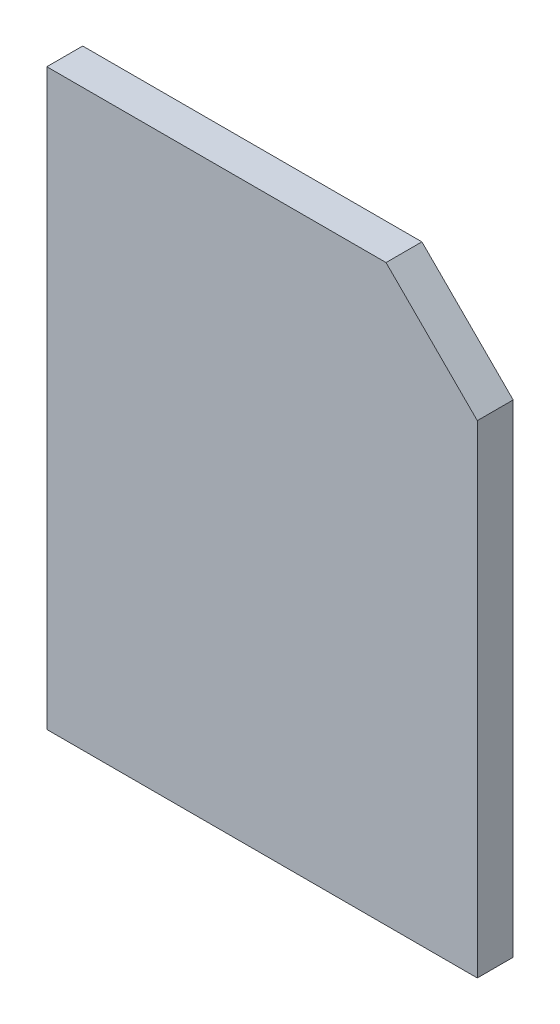
ISO-10303-21;
HEADER;
FILE_DESCRIPTION(('STEP AP214'),'2;1');
FILE_NAME('part.step','',(''),(''),'','','');
FILE_SCHEMA(('AUTOMOTIVE_DESIGN { 1 0 10303 214 1 1 1 1 }'));
ENDSEC;
DATA;
#1=APPLICATION_CONTEXT('core data for automotive mechanical design processes');
#2=APPLICATION_PROTOCOL_DEFINITION('international standard','automotive_design',2000,#1);
#3=PRODUCT_CONTEXT('',#1,'mechanical');
#4=PRODUCT('Part','Part','',(#3));
#5=PRODUCT_RELATED_PRODUCT_CATEGORY('part','',(#4));
#6=PRODUCT_DEFINITION_FORMATION('','',#4);
#7=PRODUCT_DEFINITION_CONTEXT('part definition',#1,'design');
#8=PRODUCT_DEFINITION('design','',#6,#7);
#9=PRODUCT_DEFINITION_SHAPE('','',#8);
#10=(LENGTH_UNIT() NAMED_UNIT(*) SI_UNIT(.MILLI.,.METRE.));
#11=(NAMED_UNIT(*) PLANE_ANGLE_UNIT() SI_UNIT($,.RADIAN.));
#12=(NAMED_UNIT(*) SI_UNIT($,.STERADIAN.) SOLID_ANGLE_UNIT());
#13=UNCERTAINTY_MEASURE_WITH_UNIT(LENGTH_MEASURE(1.E-05),#10,'distance_accuracy_value','');
#14=(GEOMETRIC_REPRESENTATION_CONTEXT(3) GLOBAL_UNCERTAINTY_ASSIGNED_CONTEXT((#13)) GLOBAL_UNIT_ASSIGNED_CONTEXT((#10,
#11,#12)) REPRESENTATION_CONTEXT('',''));
#15=CARTESIAN_POINT('',(0.,0.,0.));
#16=DIRECTION('',(0.,0.,1.));
#17=DIRECTION('',(1.,0.,0.));
#18=AXIS2_PLACEMENT_3D('',#15,#16,#17);
#19=CARTESIAN_POINT('',(-12.,-16.,2.));
#20=DIRECTION('',(1.,0.,0.));
#21=DIRECTION('',(0.,0.,-1.));
#22=AXIS2_PLACEMENT_3D('',#19,#20,#21);
#23=PLANE('',#22);
#24=DIRECTION('',(0.,-1.,0.));
#25=VECTOR('',#24,1.);
#26=CARTESIAN_POINT('',(-12.,-16.,0.));
#27=LINE('',#26,#25);
#28=CARTESIAN_POINT('',(-12.,16.,0.));
#29=VERTEX_POINT('',#28);
#30=CARTESIAN_POINT('',(-12.,-16.,0.));
#31=VERTEX_POINT('',#30);
#32=EDGE_CURVE('E97',#29,#31,#27,.T.);
#33=ORIENTED_EDGE('',*,*,#32,.T.);
#34=DIRECTION('',(0.,0.,-1.));
#35=VECTOR('',#34,1.);
#36=CARTESIAN_POINT('',(-12.,-16.,2.));
#37=LINE('',#36,#35);
#38=CARTESIAN_POINT('',(-12.,-16.,2.));
#39=VERTEX_POINT('',#38);
#40=EDGE_CURVE('E11',#39,#31,#37,.T.);
#41=ORIENTED_EDGE('',*,*,#40,.F.);
#42=DIRECTION('',(0.,-1.,0.));
#43=VECTOR('',#42,1.);
#44=CARTESIAN_POINT('',(-12.,-16.,2.));
#45=LINE('',#44,#43);
#46=CARTESIAN_POINT('',(-12.,16.,2.));
#47=VERTEX_POINT('',#46);
#48=EDGE_CURVE('E102',#47,#39,#45,.T.);
#49=ORIENTED_EDGE('',*,*,#48,.F.);
#50=DIRECTION('',(0.,0.,-1.));
#51=VECTOR('',#50,1.);
#52=CARTESIAN_POINT('',(-12.,16.,2.));
#53=LINE('',#52,#51);
#54=EDGE_CURVE('E110',#47,#29,#53,.T.);
#55=ORIENTED_EDGE('',*,*,#54,.T.);
#56=EDGE_LOOP('',(#33,#41,#49,#55));
#57=FACE_BOUND('',#56,.T.);
#58=ADVANCED_FACE('F35',(#57),#23,.F.);
#59=CARTESIAN_POINT('',(12.,-16.,2.));
#60=DIRECTION('',(0.,1.,0.));
#61=DIRECTION('',(0.,0.,1.));
#62=AXIS2_PLACEMENT_3D('',#59,#60,#61);
#63=PLANE('',#62);
#64=DIRECTION('',(1.,0.,0.));
#65=VECTOR('',#64,1.);
#66=CARTESIAN_POINT('',(12.,-16.,0.));
#67=LINE('',#66,#65);
#68=CARTESIAN_POINT('',(12.,-16.,0.));
#69=VERTEX_POINT('',#68);
#70=EDGE_CURVE('E106',#31,#69,#67,.T.);
#71=ORIENTED_EDGE('',*,*,#70,.T.);
#72=DIRECTION('',(0.,0.,-1.));
#73=VECTOR('',#72,1.);
#74=CARTESIAN_POINT('',(12.,-16.,2.));
#75=LINE('',#74,#73);
#76=CARTESIAN_POINT('',(12.,-16.,2.));
#77=VERTEX_POINT('',#76);
#78=EDGE_CURVE('E42',#77,#69,#75,.T.);
#79=ORIENTED_EDGE('',*,*,#78,.F.);
#80=DIRECTION('',(1.,0.,0.));
#81=VECTOR('',#80,1.);
#82=CARTESIAN_POINT('',(12.,-16.,2.));
#83=LINE('',#82,#81);
#84=EDGE_CURVE('E81',#39,#77,#83,.T.);
#85=ORIENTED_EDGE('',*,*,#84,.F.);
#86=ORIENTED_EDGE('',*,*,#40,.T.);
#87=EDGE_LOOP('',(#71,#79,#85,#86));
#88=FACE_BOUND('',#87,.T.);
#89=ADVANCED_FACE('F118',(#88),#63,.F.);
#90=CARTESIAN_POINT('',(12.,-16.,2.));
#91=DIRECTION('',(-1.,0.,0.));
#92=DIRECTION('',(0.,0.,1.));
#93=AXIS2_PLACEMENT_3D('',#90,#91,#92);
#94=PLANE('',#93);
#95=DIRECTION('',(0.,1.,0.));
#96=VECTOR('',#95,1.);
#97=CARTESIAN_POINT('',(12.,-16.,0.));
#98=LINE('',#97,#96);
#99=CARTESIAN_POINT('',(12.,10.9116882454314,0.));
#100=VERTEX_POINT('',#99);
#101=EDGE_CURVE('E103',#69,#100,#98,.T.);
#102=ORIENTED_EDGE('',*,*,#101,.T.);
#103=DIRECTION('',(0.,0.,1.));
#104=VECTOR('',#103,1.);
#105=CARTESIAN_POINT('',(12.,10.9116882454314,0.));
#106=LINE('',#105,#104);
#107=CARTESIAN_POINT('',(12.,10.9116882454314,2.));
#108=VERTEX_POINT('',#107);
#109=EDGE_CURVE('E49',#100,#108,#106,.T.);
#110=ORIENTED_EDGE('',*,*,#109,.T.);
#111=DIRECTION('',(0.,1.,0.));
#112=VECTOR('',#111,1.);
#113=CARTESIAN_POINT('',(12.,-16.,2.));
#114=LINE('',#113,#112);
#115=EDGE_CURVE('E116',#77,#108,#114,.T.);
#116=ORIENTED_EDGE('',*,*,#115,.F.);
#117=ORIENTED_EDGE('',*,*,#78,.T.);
#118=EDGE_LOOP('',(#102,#110,#116,#117));
#119=FACE_BOUND('',#118,.T.);
#120=ADVANCED_FACE('F114',(#119),#94,.F.);
#121=CARTESIAN_POINT('',(12.,16.,2.));
#122=DIRECTION('',(0.,-1.,0.));
#123=DIRECTION('',(0.,0.,-1.));
#124=AXIS2_PLACEMENT_3D('',#121,#122,#123);
#125=PLANE('',#124);
#126=DIRECTION('',(-1.,0.,0.));
#127=VECTOR('',#126,1.);
#128=CARTESIAN_POINT('',(12.,16.,2.));
#129=LINE('',#128,#127);
#130=CARTESIAN_POINT('',(6.91168824543142,16.,2.));
#131=VERTEX_POINT('',#130);
#132=EDGE_CURVE('E58',#131,#47,#129,.T.);
#133=ORIENTED_EDGE('',*,*,#132,.F.);
#134=DIRECTION('',(0.,0.,1.));
#135=VECTOR('',#134,1.);
#136=CARTESIAN_POINT('',(6.91168824543142,16.,0.));
#137=LINE('',#136,#135);
#138=CARTESIAN_POINT('',(6.91168824543142,16.,0.));
#139=VERTEX_POINT('',#138);
#140=EDGE_CURVE('E90',#139,#131,#137,.T.);
#141=ORIENTED_EDGE('',*,*,#140,.F.);
#142=DIRECTION('',(-1.,0.,0.));
#143=VECTOR('',#142,1.);
#144=CARTESIAN_POINT('',(12.,16.,0.));
#145=LINE('',#144,#143);
#146=EDGE_CURVE('E76',#139,#29,#145,.T.);
#147=ORIENTED_EDGE('',*,*,#146,.T.);
#148=ORIENTED_EDGE('',*,*,#54,.F.);
#149=EDGE_LOOP('',(#133,#141,#147,#148));
#150=FACE_BOUND('',#149,.T.);
#151=ADVANCED_FACE('F96',(#150),#125,.F.);
#152=CARTESIAN_POINT('',(0.,0.,2.));
#153=DIRECTION('',(0.,0.,1.));
#154=DIRECTION('',(1.,0.,0.));
#155=AXIS2_PLACEMENT_3D('',#152,#153,#154);
#156=PLANE('',#155);
#157=DIRECTION('',(0.707106781186548,-0.707106781186547,0.));
#158=VECTOR('',#157,1.);
#159=CARTESIAN_POINT('',(6.91168824543142,16.,2.));
#160=LINE('',#159,#158);
#161=EDGE_CURVE('E94',#131,#108,#160,.T.);
#162=ORIENTED_EDGE('',*,*,#161,.F.);
#163=ORIENTED_EDGE('',*,*,#132,.T.);
#164=ORIENTED_EDGE('',*,*,#48,.T.);
#165=ORIENTED_EDGE('',*,*,#84,.T.);
#166=ORIENTED_EDGE('',*,*,#115,.T.);
#167=EDGE_LOOP('',(#162,#163,#164,#165,#166));
#168=FACE_BOUND('',#167,.T.);
#169=ADVANCED_FACE('F127',(#168),#156,.T.);
#170=CARTESIAN_POINT('',(0.,0.,0.));
#171=DIRECTION('',(0.,0.,1.));
#172=DIRECTION('',(1.,0.,0.));
#173=AXIS2_PLACEMENT_3D('',#170,#171,#172);
#174=PLANE('',#173);
#175=ORIENTED_EDGE('',*,*,#146,.F.);
#176=DIRECTION('',(0.707106781186548,-0.707106781186547,0.));
#177=VECTOR('',#176,1.);
#178=CARTESIAN_POINT('',(6.91168824543142,16.,0.));
#179=LINE('',#178,#177);
#180=EDGE_CURVE('E88',#139,#100,#179,.T.);
#181=ORIENTED_EDGE('',*,*,#180,.T.);
#182=ORIENTED_EDGE('',*,*,#101,.F.);
#183=ORIENTED_EDGE('',*,*,#70,.F.);
#184=ORIENTED_EDGE('',*,*,#32,.F.);
#185=EDGE_LOOP('',(#175,#181,#182,#183,#184));
#186=FACE_BOUND('',#185,.T.);
#187=ADVANCED_FACE('F100',(#186),#174,.F.);
#188=CARTESIAN_POINT('',(6.91168824543142,16.,0.));
#189=DIRECTION('',(-0.707106781186547,-0.707106781186548,0.));
#190=DIRECTION('',(0.707106781186548,-0.707106781186547,0.));
#191=AXIS2_PLACEMENT_3D('',#188,#189,#190);
#192=PLANE('',#191);
#193=ORIENTED_EDGE('',*,*,#161,.T.);
#194=ORIENTED_EDGE('',*,*,#109,.F.);
#195=ORIENTED_EDGE('',*,*,#180,.F.);
#196=ORIENTED_EDGE('',*,*,#140,.T.);
#197=EDGE_LOOP('',(#193,#194,#195,#196));
#198=FACE_BOUND('',#197,.T.);
#199=ADVANCED_FACE('F89',(#198),#192,.F.);
#200=CLOSED_SHELL('',(#58,#89,#120,#151,#169,#187,#199));
#201=MANIFOLD_SOLID_BREP('B2',#200);
#202=ADVANCED_BREP_SHAPE_REPRESENTATION('',(#18,#201),#14);
#203=SHAPE_DEFINITION_REPRESENTATION(#9,#202);
ENDSEC;
END-ISO-10303-21;
